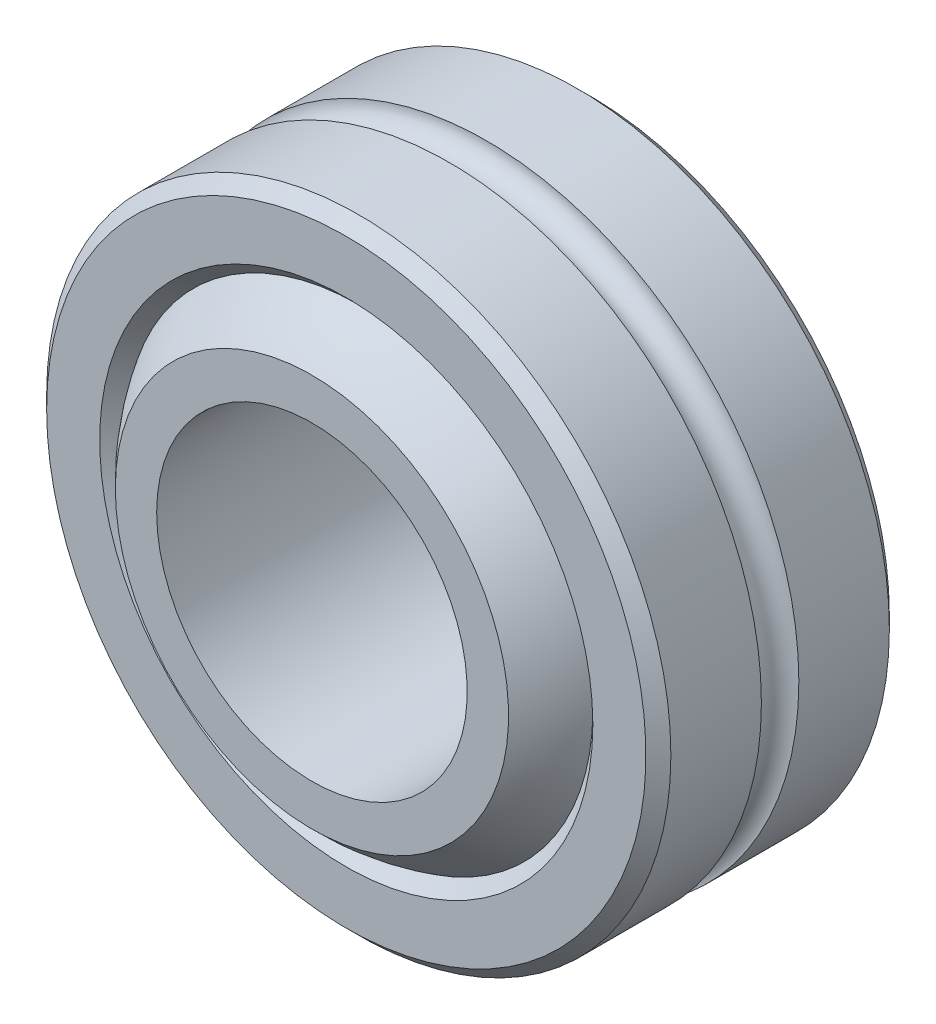
ISO-10303-21;
HEADER;
FILE_DESCRIPTION(('STEP AP214'),'2;1');
FILE_NAME('part.step','',(''),(''),'','','');
FILE_SCHEMA(('AUTOMOTIVE_DESIGN { 1 0 10303 214 1 1 1 1 }'));
ENDSEC;
DATA;
#1=APPLICATION_CONTEXT('core data for automotive mechanical design processes');
#2=APPLICATION_PROTOCOL_DEFINITION('international standard','automotive_design',2000,#1);
#3=PRODUCT_CONTEXT('',#1,'mechanical');
#4=PRODUCT('Part','Part','',(#3));
#5=PRODUCT_RELATED_PRODUCT_CATEGORY('part','',(#4));
#6=PRODUCT_DEFINITION_FORMATION('','',#4);
#7=PRODUCT_DEFINITION_CONTEXT('part definition',#1,'design');
#8=PRODUCT_DEFINITION('design','',#6,#7);
#9=PRODUCT_DEFINITION_SHAPE('','',#8);
#10=(LENGTH_UNIT() NAMED_UNIT(*) SI_UNIT(.MILLI.,.METRE.));
#11=(NAMED_UNIT(*) PLANE_ANGLE_UNIT() SI_UNIT($,.RADIAN.));
#12=(NAMED_UNIT(*) SI_UNIT($,.STERADIAN.) SOLID_ANGLE_UNIT());
#13=UNCERTAINTY_MEASURE_WITH_UNIT(LENGTH_MEASURE(1.E-05),#10,'distance_accuracy_value','');
#14=(GEOMETRIC_REPRESENTATION_CONTEXT(3) GLOBAL_UNCERTAINTY_ASSIGNED_CONTEXT((#13)) GLOBAL_UNIT_ASSIGNED_CONTEXT((#10,
#11,#12)) REPRESENTATION_CONTEXT('',''));
#15=CARTESIAN_POINT('',(0.,0.,0.));
#16=DIRECTION('',(0.,0.,1.));
#17=DIRECTION('',(1.,0.,0.));
#18=AXIS2_PLACEMENT_3D('',#15,#16,#17);
#19=CARTESIAN_POINT('',(0.,0.,-3.21968568860641E-13));
#20=DIRECTION('',(0.,0.,-1.));
#21=DIRECTION('',(0.,1.,0.));
#22=AXIS2_PLACEMENT_3D('',#19,#20,#21);
#23=TOROIDAL_SURFACE('',#22,12.6999999999997,0.761999999999683);
#24=CARTESIAN_POINT('',(0.,0.,0.761999999999985));
#25=DIRECTION('',(0.,0.,1.));
#26=DIRECTION('',(1.,0.,0.));
#27=AXIS2_PLACEMENT_3D('',#24,#25,#26);
#28=CIRCLE('',#27,12.7);
#29=CARTESIAN_POINT('',(12.7,0.,0.761999999999985));
#30=VERTEX_POINT('',#29);
#31=EDGE_CURVE('E30',#30,#30,#28,.T.);
#32=ORIENTED_EDGE('',*,*,#31,.F.);
#33=EDGE_LOOP('',(#32));
#34=FACE_BOUND('',#33,.T.);
#35=CARTESIAN_POINT('',(0.,0.,-0.761999999999986));
#36=DIRECTION('',(0.,0.,-1.));
#37=DIRECTION('',(-1.,0.,0.));
#38=AXIS2_PLACEMENT_3D('',#35,#36,#37);
#39=CIRCLE('',#38,12.7);
#40=CARTESIAN_POINT('',(-12.7,0.,-0.761999999999986));
#41=VERTEX_POINT('',#40);
#42=EDGE_CURVE('E59',#41,#41,#39,.T.);
#43=ORIENTED_EDGE('',*,*,#42,.F.);
#44=EDGE_LOOP('',(#43));
#45=FACE_BOUND('',#44,.T.);
#46=ADVANCED_FACE('F14',(#34,#45),#23,.F.);
#47=CARTESIAN_POINT('',(0.,0.,4.8133));
#48=DIRECTION('',(0.,0.,-1.));
#49=DIRECTION('',(-1.,0.,0.));
#50=AXIS2_PLACEMENT_3D('',#47,#48,#49);
#51=CYLINDRICAL_SURFACE('',#50,12.7);
#52=ORIENTED_EDGE('',*,*,#31,.T.);
#53=EDGE_LOOP('',(#52));
#54=FACE_BOUND('',#53,.T.);
#55=CARTESIAN_POINT('',(0.,0.,4.445));
#56=DIRECTION('',(0.,0.,1.));
#57=DIRECTION('',(1.,0.,0.));
#58=AXIS2_PLACEMENT_3D('',#55,#56,#57);
#59=CIRCLE('',#58,12.7);
#60=CARTESIAN_POINT('',(12.7,0.,4.445));
#61=VERTEX_POINT('',#60);
#62=EDGE_CURVE('E54',#61,#61,#59,.T.);
#63=ORIENTED_EDGE('',*,*,#62,.F.);
#64=EDGE_LOOP('',(#63));
#65=FACE_BOUND('',#64,.T.);
#66=ADVANCED_FACE('F69',(#54,#65),#51,.T.);
#67=CARTESIAN_POINT('',(0.,0.,-0.3937));
#68=DIRECTION('',(0.,0.,-1.));
#69=DIRECTION('',(0.,1.,0.));
#70=AXIS2_PLACEMENT_3D('',#67,#68,#69);
#71=CYLINDRICAL_SURFACE('',#70,12.7);
#72=CARTESIAN_POINT('',(0.,0.,-4.445));
#73=DIRECTION('',(0.,0.,-1.));
#74=DIRECTION('',(-1.,0.,0.));
#75=AXIS2_PLACEMENT_3D('',#72,#73,#74);
#76=CIRCLE('',#75,12.7);
#77=CARTESIAN_POINT('',(-12.7,0.,-4.445));
#78=VERTEX_POINT('',#77);
#79=EDGE_CURVE('E50',#78,#78,#76,.T.);
#80=ORIENTED_EDGE('',*,*,#79,.F.);
#81=EDGE_LOOP('',(#80));
#82=FACE_BOUND('',#81,.T.);
#83=ORIENTED_EDGE('',*,*,#42,.T.);
#84=EDGE_LOOP('',(#83));
#85=FACE_BOUND('',#84,.T.);
#86=ADVANCED_FACE('F79',(#82,#85),#71,.T.);
#87=CARTESIAN_POINT('',(0.,0.,4.3942));
#88=DIRECTION('',(0.,0.,-1.));
#89=DIRECTION('',(-1.,0.,0.));
#90=AXIS2_PLACEMENT_3D('',#87,#88,#89);
#91=CONICAL_SURFACE('',#90,12.7508,0.785398163397447);
#92=ORIENTED_EDGE('',*,*,#62,.T.);
#93=EDGE_LOOP('',(#92));
#94=FACE_BOUND('',#93,.T.);
#95=CARTESIAN_POINT('',(0.,0.,4.95299999999999));
#96=DIRECTION('',(0.,0.,-1.));
#97=DIRECTION('',(-1.,0.,0.));
#98=AXIS2_PLACEMENT_3D('',#95,#96,#97);
#99=CIRCLE('',#98,12.192);
#100=CARTESIAN_POINT('',(-12.192,0.,4.95299999999999));
#101=VERTEX_POINT('',#100);
#102=EDGE_CURVE('E18',#101,#101,#99,.F.);
#103=ORIENTED_EDGE('',*,*,#102,.F.);
#104=EDGE_LOOP('',(#103));
#105=FACE_BOUND('',#104,.T.);
#106=ADVANCED_FACE('F206',(#94,#105),#91,.T.);
#107=CARTESIAN_POINT('',(0.,0.,-4.3942));
#108=DIRECTION('',(0.,0.,1.));
#109=DIRECTION('',(1.,0.,0.));
#110=AXIS2_PLACEMENT_3D('',#107,#108,#109);
#111=CONICAL_SURFACE('',#110,12.7508,0.785398163397447);
#112=ORIENTED_EDGE('',*,*,#79,.T.);
#113=EDGE_LOOP('',(#112));
#114=FACE_BOUND('',#113,.T.);
#115=CARTESIAN_POINT('',(0.,0.,-4.95299999999999));
#116=DIRECTION('',(0.,0.,1.));
#117=DIRECTION('',(1.,0.,0.));
#118=AXIS2_PLACEMENT_3D('',#115,#116,#117);
#119=CIRCLE('',#118,12.192);
#120=CARTESIAN_POINT('',(12.192,0.,-4.95299999999999));
#121=VERTEX_POINT('',#120);
#122=EDGE_CURVE('E45',#121,#121,#119,.F.);
#123=ORIENTED_EDGE('',*,*,#122,.F.);
#124=EDGE_LOOP('',(#123));
#125=FACE_BOUND('',#124,.T.);
#126=ADVANCED_FACE('F196',(#114,#125),#111,.T.);
#127=CARTESIAN_POINT('',(-12.338304,-12.338304,4.953));
#128=DIRECTION('',(0.,0.,1.));
#129=DIRECTION('',(1.,0.,0.));
#130=AXIS2_PLACEMENT_3D('',#127,#128,#129);
#131=PLANE('',#130);
#132=CARTESIAN_POINT('',(0.,0.,4.95300000000001));
#133=DIRECTION('',(0.,0.,1.));
#134=DIRECTION('',(1.,0.,0.));
#135=AXIS2_PLACEMENT_3D('',#132,#133,#134);
#136=CIRCLE('',#135,10.033);
#137=CARTESIAN_POINT('',(10.033,0.,4.95300000000001));
#138=VERTEX_POINT('',#137);
#139=EDGE_CURVE('E43',#138,#138,#136,.T.);
#140=ORIENTED_EDGE('',*,*,#139,.F.);
#141=EDGE_LOOP('',(#140));
#142=FACE_BOUND('',#141,.T.);
#143=ORIENTED_EDGE('',*,*,#102,.T.);
#144=EDGE_LOOP('',(#143));
#145=FACE_BOUND('',#144,.T.);
#146=ADVANCED_FACE('F187',(#142,#145),#131,.T.);
#147=CARTESIAN_POINT('',(12.338304,-12.338304,-4.953));
#148=DIRECTION('',(0.,0.,-1.));
#149=DIRECTION('',(-1.,0.,0.));
#150=AXIS2_PLACEMENT_3D('',#147,#148,#149);
#151=PLANE('',#150);
#152=CARTESIAN_POINT('',(0.,0.,-4.95300000000001));
#153=DIRECTION('',(0.,0.,-1.));
#154=DIRECTION('',(-1.,0.,0.));
#155=AXIS2_PLACEMENT_3D('',#152,#153,#154);
#156=CIRCLE('',#155,10.033);
#157=CARTESIAN_POINT('',(-10.033,0.,-4.95300000000001));
#158=VERTEX_POINT('',#157);
#159=EDGE_CURVE('E39',#158,#158,#156,.T.);
#160=ORIENTED_EDGE('',*,*,#159,.F.);
#161=EDGE_LOOP('',(#160));
#162=FACE_BOUND('',#161,.T.);
#163=ORIENTED_EDGE('',*,*,#122,.T.);
#164=EDGE_LOOP('',(#163));
#165=FACE_BOUND('',#164,.T.);
#166=ADVANCED_FACE('F117',(#162,#165),#151,.T.);
#167=CARTESIAN_POINT('',(0.,0.,4.445));
#168=DIRECTION('',(0.,0.,1.));
#169=DIRECTION('',(1.,0.,0.));
#170=AXIS2_PLACEMENT_3D('',#167,#168,#169);
#171=CONICAL_SURFACE('',#170,9.525,0.785398163397447);
#172=ORIENTED_EDGE('',*,*,#139,.T.);
#173=EDGE_LOOP('',(#172));
#174=FACE_BOUND('',#173,.T.);
#175=CARTESIAN_POINT('',(0.,0.,4.445));
#176=DIRECTION('',(0.,0.,1.));
#177=DIRECTION('',(1.,0.,0.));
#178=AXIS2_PLACEMENT_3D('',#175,#176,#177);
#179=CIRCLE('',#178,9.525);
#180=CARTESIAN_POINT('',(9.525,0.,4.445));
#181=VERTEX_POINT('',#180);
#182=EDGE_CURVE('E42',#181,#181,#179,.T.);
#183=ORIENTED_EDGE('',*,*,#182,.F.);
#184=EDGE_LOOP('',(#183));
#185=FACE_BOUND('',#184,.T.);
#186=ADVANCED_FACE('F111',(#174,#185),#171,.F.);
#187=CARTESIAN_POINT('',(0.,0.,-4.445));
#188=DIRECTION('',(0.,0.,-1.));
#189=DIRECTION('',(-1.,0.,0.));
#190=AXIS2_PLACEMENT_3D('',#187,#188,#189);
#191=CONICAL_SURFACE('',#190,9.525,0.785398163397447);
#192=ORIENTED_EDGE('',*,*,#159,.T.);
#193=EDGE_LOOP('',(#192));
#194=FACE_BOUND('',#193,.T.);
#195=CARTESIAN_POINT('',(0.,0.,-4.445));
#196=DIRECTION('',(0.,0.,-1.));
#197=DIRECTION('',(-1.,0.,0.));
#198=AXIS2_PLACEMENT_3D('',#195,#196,#197);
#199=CIRCLE('',#198,9.525);
#200=CARTESIAN_POINT('',(-9.525,0.,-4.445));
#201=VERTEX_POINT('',#200);
#202=EDGE_CURVE('E38',#201,#201,#199,.T.);
#203=ORIENTED_EDGE('',*,*,#202,.F.);
#204=EDGE_LOOP('',(#203));
#205=FACE_BOUND('',#204,.T.);
#206=ADVANCED_FACE('F100',(#194,#205),#191,.F.);
#207=CARTESIAN_POINT('',(0.,0.,-1.12921202099494E-12));
#208=DIRECTION('',(0.,0.,-1.));
#209=DIRECTION('',(-1.,0.,0.));
#210=AXIS2_PLACEMENT_3D('',#207,#208,#209);
#211=DEGENERATE_TOROIDAL_SURFACE('',#210,2.0216031110073,8.72118053211579,.T.);
#212=CARTESIAN_POINT('',(0.,0.,6.34999999999992));
#213=DIRECTION('',(0.,0.,-1.));
#214=DIRECTION('',(-1.,0.,0.));
#215=AXIS2_PLACEMENT_3D('',#212,#213,#214);
#216=CIRCLE('',#215,7.99960360228715);
#217=CARTESIAN_POINT('',(-7.99960360228715,0.,6.34999999999992));
#218=VERTEX_POINT('',#217);
#219=EDGE_CURVE('E35',#218,#218,#216,.F.);
#220=ORIENTED_EDGE('',*,*,#219,.F.);
#221=EDGE_LOOP('',(#220));
#222=FACE_BOUND('',#221,.T.);
#223=ORIENTED_EDGE('',*,*,#182,.T.);
#224=EDGE_LOOP('',(#223));
#225=FACE_BOUND('',#224,.T.);
#226=ADVANCED_FACE('F97',(#222,#225),#211,.T.);
#227=CARTESIAN_POINT('',(0.,0.,1.12921456209378E-12));
#228=DIRECTION('',(0.,0.,-1.));
#229=DIRECTION('',(-1.,0.,0.));
#230=AXIS2_PLACEMENT_3D('',#227,#228,#229);
#231=DEGENERATE_TOROIDAL_SURFACE('',#230,2.0216031110073,8.72118053211579,.T.);
#232=ORIENTED_EDGE('',*,*,#202,.T.);
#233=EDGE_LOOP('',(#232));
#234=FACE_BOUND('',#233,.T.);
#235=CARTESIAN_POINT('',(0.,0.,-6.34999999999992));
#236=DIRECTION('',(0.,0.,-1.));
#237=DIRECTION('',(-1.,0.,0.));
#238=AXIS2_PLACEMENT_3D('',#235,#236,#237);
#239=CIRCLE('',#238,7.99960360228715);
#240=CARTESIAN_POINT('',(-7.99960360228715,0.,-6.34999999999992));
#241=VERTEX_POINT('',#240);
#242=EDGE_CURVE('E27',#241,#241,#239,.T.);
#243=ORIENTED_EDGE('',*,*,#242,.F.);
#244=EDGE_LOOP('',(#243));
#245=FACE_BOUND('',#244,.T.);
#246=ADVANCED_FACE('F93',(#234,#245),#231,.T.);
#247=CARTESIAN_POINT('',(-8.09559884551466,-8.09559884551466,6.35));
#248=DIRECTION('',(0.,0.,1.));
#249=DIRECTION('',(1.,0.,0.));
#250=AXIS2_PLACEMENT_3D('',#247,#248,#249);
#251=PLANE('',#250);
#252=CARTESIAN_POINT('',(0.,0.,6.35));
#253=DIRECTION('',(0.,0.,-1.));
#254=DIRECTION('',(-1.,0.,0.));
#255=AXIS2_PLACEMENT_3D('',#252,#253,#254);
#256=CIRCLE('',#255,6.31825);
#257=CARTESIAN_POINT('',(-6.31825,0.,6.35));
#258=VERTEX_POINT('',#257);
#259=EDGE_CURVE('E22',#258,#258,#256,.F.);
#260=ORIENTED_EDGE('',*,*,#259,.F.);
#261=EDGE_LOOP('',(#260));
#262=FACE_BOUND('',#261,.T.);
#263=ORIENTED_EDGE('',*,*,#219,.T.);
#264=EDGE_LOOP('',(#263));
#265=FACE_BOUND('',#264,.T.);
#266=ADVANCED_FACE('F86',(#262,#265),#251,.T.);
#267=CARTESIAN_POINT('',(8.09559884551466,-8.09559884551466,-6.35));
#268=DIRECTION('',(0.,0.,-1.));
#269=DIRECTION('',(-1.,0.,0.));
#270=AXIS2_PLACEMENT_3D('',#267,#268,#269);
#271=PLANE('',#270);
#272=CARTESIAN_POINT('',(0.,0.,-6.35));
#273=DIRECTION('',(0.,0.,-1.));
#274=DIRECTION('',(-1.,0.,0.));
#275=AXIS2_PLACEMENT_3D('',#272,#273,#274);
#276=CIRCLE('',#275,6.31825);
#277=CARTESIAN_POINT('',(-6.31825,0.,-6.35));
#278=VERTEX_POINT('',#277);
#279=EDGE_CURVE('E10',#278,#278,#276,.T.);
#280=ORIENTED_EDGE('',*,*,#279,.F.);
#281=EDGE_LOOP('',(#280));
#282=FACE_BOUND('',#281,.T.);
#283=ORIENTED_EDGE('',*,*,#242,.T.);
#284=EDGE_LOOP('',(#283));
#285=FACE_BOUND('',#284,.T.);
#286=ADVANCED_FACE('F82',(#282,#285),#271,.T.);
#287=CARTESIAN_POINT('',(0.,0.,6.35));
#288=DIRECTION('',(0.,0.,-1.));
#289=DIRECTION('',(-1.,0.,0.));
#290=AXIS2_PLACEMENT_3D('',#287,#288,#289);
#291=CYLINDRICAL_SURFACE('',#290,6.31825);
#292=ORIENTED_EDGE('',*,*,#279,.T.);
#293=EDGE_LOOP('',(#292));
#294=FACE_BOUND('',#293,.T.);
#295=ORIENTED_EDGE('',*,*,#259,.T.);
#296=EDGE_LOOP('',(#295));
#297=FACE_BOUND('',#296,.T.);
#298=ADVANCED_FACE('F16',(#294,#297),#291,.F.);
#299=CLOSED_SHELL('',(#46,#66,#86,#106,#126,#146,#166,#186,#206,#226,#246,#266,#286,#298));
#300=MANIFOLD_SOLID_BREP('B1',#299);
#301=ADVANCED_BREP_SHAPE_REPRESENTATION('',(#18,#300),#14);
#302=SHAPE_DEFINITION_REPRESENTATION(#9,#301);
ENDSEC;
END-ISO-10303-21;
